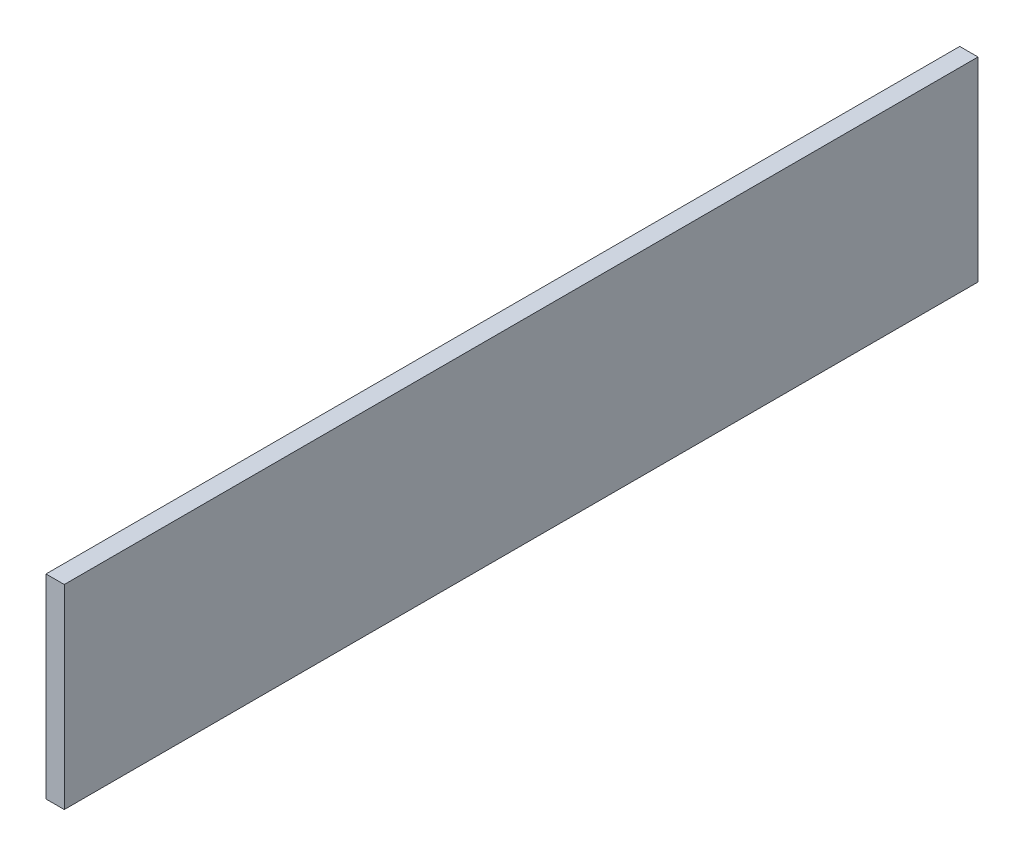
ISO-10303-21;
HEADER;
FILE_DESCRIPTION(('STEP AP214'),'2;1');
FILE_NAME('part.step','',(''),(''),'','','');
FILE_SCHEMA(('AUTOMOTIVE_DESIGN { 1 0 10303 214 1 1 1 1 }'));
ENDSEC;
DATA;
#1=APPLICATION_CONTEXT('core data for automotive mechanical design processes');
#2=APPLICATION_PROTOCOL_DEFINITION('international standard','automotive_design',2000,#1);
#3=PRODUCT_CONTEXT('',#1,'mechanical');
#4=PRODUCT('Part','Part','',(#3));
#5=PRODUCT_RELATED_PRODUCT_CATEGORY('part','',(#4));
#6=PRODUCT_DEFINITION_FORMATION('','',#4);
#7=PRODUCT_DEFINITION_CONTEXT('part definition',#1,'design');
#8=PRODUCT_DEFINITION('design','',#6,#7);
#9=PRODUCT_DEFINITION_SHAPE('','',#8);
#10=(LENGTH_UNIT() NAMED_UNIT(*) SI_UNIT(.MILLI.,.METRE.));
#11=(NAMED_UNIT(*) PLANE_ANGLE_UNIT() SI_UNIT($,.RADIAN.));
#12=(NAMED_UNIT(*) SI_UNIT($,.STERADIAN.) SOLID_ANGLE_UNIT());
#13=UNCERTAINTY_MEASURE_WITH_UNIT(LENGTH_MEASURE(1.E-05),#10,'distance_accuracy_value','');
#14=(GEOMETRIC_REPRESENTATION_CONTEXT(3) GLOBAL_UNCERTAINTY_ASSIGNED_CONTEXT((#13)) GLOBAL_UNIT_ASSIGNED_CONTEXT((#10,
#11,#12)) REPRESENTATION_CONTEXT('',''));
#15=CARTESIAN_POINT('',(0.,0.,0.));
#16=DIRECTION('',(0.,0.,1.));
#17=DIRECTION('',(1.,0.,0.));
#18=AXIS2_PLACEMENT_3D('',#15,#16,#17);
#19=CARTESIAN_POINT('',(30.,418.055555555556,851.851851851852));
#20=DIRECTION('',(0.,0.,-1.));
#21=DIRECTION('',(-1.,0.,0.));
#22=AXIS2_PLACEMENT_3D('',#19,#20,#21);
#23=PLANE('',#22);
#24=DIRECTION('',(0.,-1.,0.));
#25=VECTOR('',#24,1.);
#26=CARTESIAN_POINT('',(0.,418.055555555556,851.851851851852));
#27=LINE('',#26,#25);
#28=CARTESIAN_POINT('',(0.,418.055555555556,851.851851851852));
#29=VERTEX_POINT('',#28);
#30=CARTESIAN_POINT('',(0.,98.0555555555556,851.851851851852));
#31=VERTEX_POINT('',#30);
#32=EDGE_CURVE('E107',#29,#31,#27,.T.);
#33=ORIENTED_EDGE('',*,*,#32,.T.);
#34=DIRECTION('',(-1.,0.,0.));
#35=VECTOR('',#34,1.);
#36=CARTESIAN_POINT('',(30.,98.0555555555556,851.851851851852));
#37=LINE('',#36,#35);
#38=CARTESIAN_POINT('',(30.,98.0555555555556,851.851851851852));
#39=VERTEX_POINT('',#38);
#40=EDGE_CURVE('E11',#39,#31,#37,.T.);
#41=ORIENTED_EDGE('',*,*,#40,.F.);
#42=DIRECTION('',(0.,-1.,0.));
#43=VECTOR('',#42,1.);
#44=CARTESIAN_POINT('',(30.,418.055555555556,851.851851851852));
#45=LINE('',#44,#43);
#46=CARTESIAN_POINT('',(30.,418.055555555556,851.851851851852));
#47=VERTEX_POINT('',#46);
#48=EDGE_CURVE('E91',#47,#39,#45,.T.);
#49=ORIENTED_EDGE('',*,*,#48,.F.);
#50=DIRECTION('',(-1.,0.,0.));
#51=VECTOR('',#50,1.);
#52=CARTESIAN_POINT('',(30.,418.055555555556,851.851851851852));
#53=LINE('',#52,#51);
#54=EDGE_CURVE('E103',#47,#29,#53,.T.);
#55=ORIENTED_EDGE('',*,*,#54,.T.);
#56=EDGE_LOOP('',(#33,#41,#49,#55));
#57=FACE_BOUND('',#56,.T.);
#58=ADVANCED_FACE('F39',(#57),#23,.F.);
#59=CARTESIAN_POINT('',(30.,98.0555555555556,851.851851851852));
#60=DIRECTION('',(0.,1.,0.));
#61=DIRECTION('',(0.,0.,1.));
#62=AXIS2_PLACEMENT_3D('',#59,#60,#61);
#63=PLANE('',#62);
#64=DIRECTION('',(0.,0.,-1.));
#65=VECTOR('',#64,1.);
#66=CARTESIAN_POINT('',(0.,98.0555555555556,851.851851851852));
#67=LINE('',#66,#65);
#68=CARTESIAN_POINT('',(0.,98.0555555555556,-648.148148148148));
#69=VERTEX_POINT('',#68);
#70=EDGE_CURVE('E96',#31,#69,#67,.T.);
#71=ORIENTED_EDGE('',*,*,#70,.T.);
#72=DIRECTION('',(-1.,0.,0.));
#73=VECTOR('',#72,1.);
#74=CARTESIAN_POINT('',(30.,98.0555555555556,-648.148148148148));
#75=LINE('',#74,#73);
#76=CARTESIAN_POINT('',(30.,98.0555555555556,-648.148148148148));
#77=VERTEX_POINT('',#76);
#78=EDGE_CURVE('E48',#77,#69,#75,.T.);
#79=ORIENTED_EDGE('',*,*,#78,.F.);
#80=DIRECTION('',(0.,0.,-1.));
#81=VECTOR('',#80,1.);
#82=CARTESIAN_POINT('',(30.,98.0555555555556,851.851851851852));
#83=LINE('',#82,#81);
#84=EDGE_CURVE('E86',#39,#77,#83,.T.);
#85=ORIENTED_EDGE('',*,*,#84,.F.);
#86=ORIENTED_EDGE('',*,*,#40,.T.);
#87=EDGE_LOOP('',(#71,#79,#85,#86));
#88=FACE_BOUND('',#87,.T.);
#89=ADVANCED_FACE('F95',(#88),#63,.F.);
#90=CARTESIAN_POINT('',(30.,418.055555555556,-648.148148148148));
#91=DIRECTION('',(0.,0.,1.));
#92=DIRECTION('',(0.,-1.,0.));
#93=AXIS2_PLACEMENT_3D('',#90,#91,#92);
#94=PLANE('',#93);
#95=DIRECTION('',(0.,1.,0.));
#96=VECTOR('',#95,1.);
#97=CARTESIAN_POINT('',(0.,418.055555555556,-648.148148148148));
#98=LINE('',#97,#96);
#99=CARTESIAN_POINT('',(0.,418.055555555556,-648.148148148148));
#100=VERTEX_POINT('',#99);
#101=EDGE_CURVE('E73',#69,#100,#98,.T.);
#102=ORIENTED_EDGE('',*,*,#101,.T.);
#103=DIRECTION('',(-1.,0.,0.));
#104=VECTOR('',#103,1.);
#105=CARTESIAN_POINT('',(30.,418.055555555556,-648.148148148148));
#106=LINE('',#105,#104);
#107=CARTESIAN_POINT('',(30.,418.055555555556,-648.148148148148));
#108=VERTEX_POINT('',#107);
#109=EDGE_CURVE('E98',#108,#100,#106,.T.);
#110=ORIENTED_EDGE('',*,*,#109,.F.);
#111=DIRECTION('',(0.,1.,0.));
#112=VECTOR('',#111,1.);
#113=CARTESIAN_POINT('',(30.,418.055555555556,-648.148148148148));
#114=LINE('',#113,#112);
#115=EDGE_CURVE('E89',#77,#108,#114,.T.);
#116=ORIENTED_EDGE('',*,*,#115,.F.);
#117=ORIENTED_EDGE('',*,*,#78,.T.);
#118=EDGE_LOOP('',(#102,#110,#116,#117));
#119=FACE_BOUND('',#118,.T.);
#120=ADVANCED_FACE('F99',(#119),#94,.F.);
#121=CARTESIAN_POINT('',(30.,418.055555555556,851.851851851852));
#122=DIRECTION('',(0.,-1.,0.));
#123=DIRECTION('',(0.,0.,-1.));
#124=AXIS2_PLACEMENT_3D('',#121,#122,#123);
#125=PLANE('',#124);
#126=DIRECTION('',(0.,0.,1.));
#127=VECTOR('',#126,1.);
#128=CARTESIAN_POINT('',(0.,418.055555555556,851.851851851852));
#129=LINE('',#128,#127);
#130=EDGE_CURVE('E79',#100,#29,#129,.T.);
#131=ORIENTED_EDGE('',*,*,#130,.T.);
#132=ORIENTED_EDGE('',*,*,#54,.F.);
#133=DIRECTION('',(0.,0.,1.));
#134=VECTOR('',#133,1.);
#135=CARTESIAN_POINT('',(30.,418.055555555556,851.851851851852));
#136=LINE('',#135,#134);
#137=EDGE_CURVE('E56',#108,#47,#136,.T.);
#138=ORIENTED_EDGE('',*,*,#137,.F.);
#139=ORIENTED_EDGE('',*,*,#109,.T.);
#140=EDGE_LOOP('',(#131,#132,#138,#139));
#141=FACE_BOUND('',#140,.T.);
#142=ADVANCED_FACE('F120',(#141),#125,.F.);
#143=CARTESIAN_POINT('',(30.,0.,0.));
#144=DIRECTION('',(1.,0.,0.));
#145=DIRECTION('',(0.,0.,-1.));
#146=AXIS2_PLACEMENT_3D('',#143,#144,#145);
#147=PLANE('',#146);
#148=ORIENTED_EDGE('',*,*,#48,.T.);
#149=ORIENTED_EDGE('',*,*,#84,.T.);
#150=ORIENTED_EDGE('',*,*,#115,.T.);
#151=ORIENTED_EDGE('',*,*,#137,.T.);
#152=EDGE_LOOP('',(#148,#149,#150,#151));
#153=FACE_BOUND('',#152,.T.);
#154=ADVANCED_FACE('F87',(#153),#147,.T.);
#155=CARTESIAN_POINT('',(0.,0.,0.));
#156=DIRECTION('',(1.,0.,0.));
#157=DIRECTION('',(0.,0.,-1.));
#158=AXIS2_PLACEMENT_3D('',#155,#156,#157);
#159=PLANE('',#158);
#160=ORIENTED_EDGE('',*,*,#32,.F.);
#161=ORIENTED_EDGE('',*,*,#130,.F.);
#162=ORIENTED_EDGE('',*,*,#101,.F.);
#163=ORIENTED_EDGE('',*,*,#70,.F.);
#164=EDGE_LOOP('',(#160,#161,#162,#163));
#165=FACE_BOUND('',#164,.T.);
#166=ADVANCED_FACE('F123',(#165),#159,.F.);
#167=CLOSED_SHELL('',(#58,#89,#120,#142,#154,#166));
#168=MANIFOLD_SOLID_BREP('B2',#167);
#169=ADVANCED_BREP_SHAPE_REPRESENTATION('',(#18,#168),#14);
#170=SHAPE_DEFINITION_REPRESENTATION(#9,#169);
ENDSEC;
END-ISO-10303-21;
